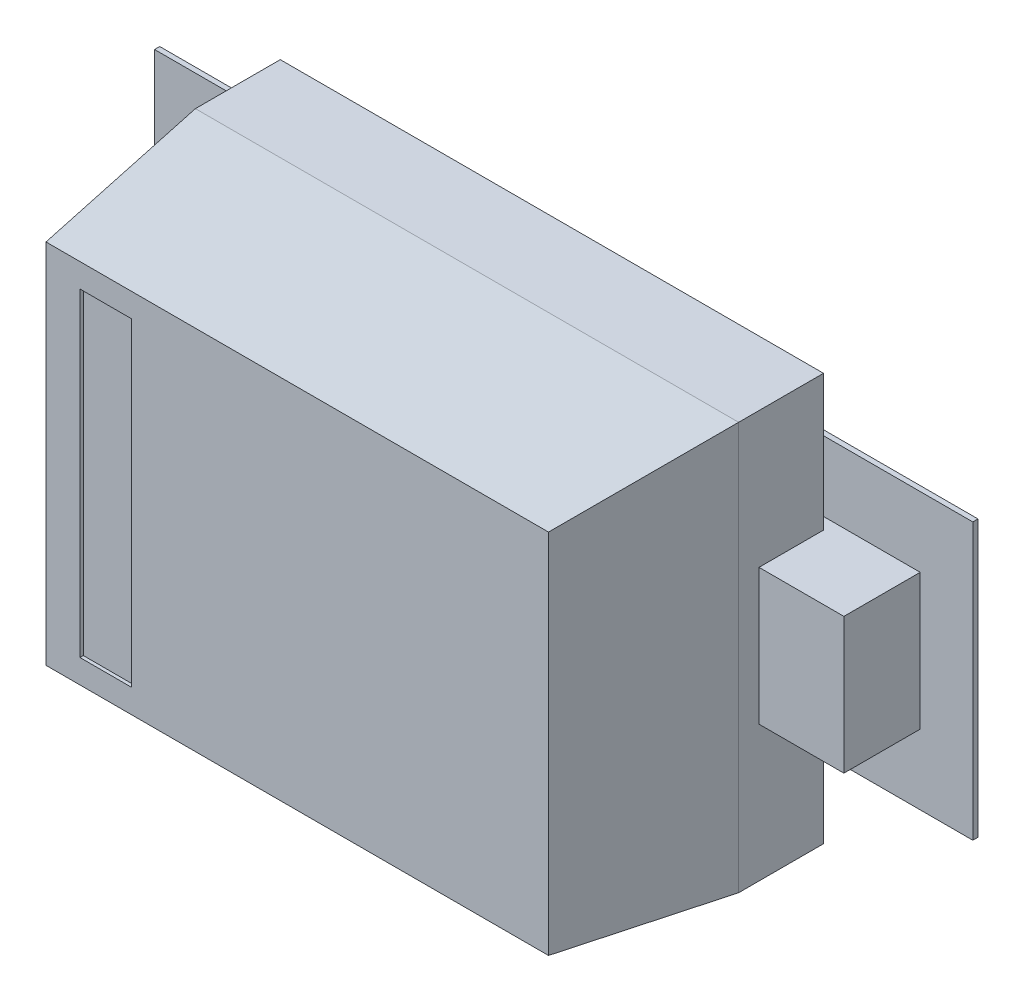
ISO-10303-21;
HEADER;
FILE_DESCRIPTION(('STEP AP214'),'2;1');
FILE_NAME('part.step','',(''),(''),'','','');
FILE_SCHEMA(('AUTOMOTIVE_DESIGN { 1 0 10303 214 1 1 1 1 }'));
ENDSEC;
DATA;
#1=APPLICATION_CONTEXT('core data for automotive mechanical design processes');
#2=APPLICATION_PROTOCOL_DEFINITION('international standard','automotive_design',2000,#1);
#3=PRODUCT_CONTEXT('',#1,'mechanical');
#4=PRODUCT('Part','Part','',(#3));
#5=PRODUCT_RELATED_PRODUCT_CATEGORY('part','',(#4));
#6=PRODUCT_DEFINITION_FORMATION('','',#4);
#7=PRODUCT_DEFINITION_CONTEXT('part definition',#1,'design');
#8=PRODUCT_DEFINITION('design','',#6,#7);
#9=PRODUCT_DEFINITION_SHAPE('','',#8);
#10=(LENGTH_UNIT() NAMED_UNIT(*) SI_UNIT(.MILLI.,.METRE.));
#11=(NAMED_UNIT(*) PLANE_ANGLE_UNIT() SI_UNIT($,.RADIAN.));
#12=(NAMED_UNIT(*) SI_UNIT($,.STERADIAN.) SOLID_ANGLE_UNIT());
#13=UNCERTAINTY_MEASURE_WITH_UNIT(LENGTH_MEASURE(1.E-05),#10,'distance_accuracy_value','');
#14=(GEOMETRIC_REPRESENTATION_CONTEXT(3) GLOBAL_UNCERTAINTY_ASSIGNED_CONTEXT((#13)) GLOBAL_UNIT_ASSIGNED_CONTEXT((#10,
#11,#12)) REPRESENTATION_CONTEXT('',''));
#15=CARTESIAN_POINT('',(0.,0.,0.));
#16=DIRECTION('',(0.,0.,1.));
#17=DIRECTION('',(1.,0.,0.));
#18=AXIS2_PLACEMENT_3D('',#15,#16,#17);
#19=CARTESIAN_POINT('',(-0.525,-0.1,0.0762));
#20=DIRECTION('',(-1.,0.,0.));
#21=DIRECTION('',(0.,0.,1.));
#22=AXIS2_PLACEMENT_3D('',#19,#20,#21);
#23=PLANE('',#22);
#24=DIRECTION('',(0.,1.,0.));
#25=VECTOR('',#24,1.);
#26=CARTESIAN_POINT('',(-0.525,-0.1,0.08382));
#27=LINE('',#26,#25);
#28=CARTESIAN_POINT('',(-0.525,-0.1,0.08382));
#29=VERTEX_POINT('',#28);
#30=CARTESIAN_POINT('',(-0.525,0.1,0.08382));
#31=VERTEX_POINT('',#30);
#32=EDGE_CURVE('E310',#29,#31,#27,.T.);
#33=ORIENTED_EDGE('',*,*,#32,.F.);
#34=DIRECTION('',(0.,0.,1.));
#35=VECTOR('',#34,1.);
#36=CARTESIAN_POINT('',(-0.525,-0.1,0.08382));
#37=LINE('',#36,#35);
#38=CARTESIAN_POINT('',(-0.525,-0.1,0.1962));
#39=VERTEX_POINT('',#38);
#40=EDGE_CURVE('E305',#29,#39,#37,.T.);
#41=ORIENTED_EDGE('',*,*,#40,.T.);
#42=DIRECTION('',(0.,1.,0.));
#43=VECTOR('',#42,1.);
#44=CARTESIAN_POINT('',(-0.525,-0.1,0.1962));
#45=LINE('',#44,#43);
#46=CARTESIAN_POINT('',(-0.525,0.1,0.1962));
#47=VERTEX_POINT('',#46);
#48=EDGE_CURVE('E11',#39,#47,#45,.T.);
#49=ORIENTED_EDGE('',*,*,#48,.T.);
#50=DIRECTION('',(0.,0.,1.));
#51=VECTOR('',#50,1.);
#52=CARTESIAN_POINT('',(-0.525,0.1,0.08382));
#53=LINE('',#52,#51);
#54=EDGE_CURVE('E186',#31,#47,#53,.T.);
#55=ORIENTED_EDGE('',*,*,#54,.F.);
#56=EDGE_LOOP('',(#33,#41,#49,#55));
#57=FACE_BOUND('',#56,.T.);
#58=ADVANCED_FACE('F17',(#57),#23,.T.);
#59=CARTESIAN_POINT('',(-0.525,-0.1,0.1962));
#60=DIRECTION('',(0.,0.,1.));
#61=DIRECTION('',(1.,0.,0.));
#62=AXIS2_PLACEMENT_3D('',#59,#60,#61);
#63=PLANE('',#62);
#64=DIRECTION('',(1.,0.,0.));
#65=VECTOR('',#64,1.);
#66=CARTESIAN_POINT('',(-0.525,-0.1,0.1962));
#67=LINE('',#66,#65);
#68=CARTESIAN_POINT('',(-0.4,-0.1,0.1962));
#69=VERTEX_POINT('',#68);
#70=EDGE_CURVE('E321',#39,#69,#67,.T.);
#71=ORIENTED_EDGE('',*,*,#70,.T.);
#72=DIRECTION('',(0.,1.,0.));
#73=VECTOR('',#72,1.);
#74=CARTESIAN_POINT('',(-0.4,-0.1,0.1962));
#75=LINE('',#74,#73);
#76=CARTESIAN_POINT('',(-0.4,0.1,0.1962));
#77=VERTEX_POINT('',#76);
#78=EDGE_CURVE('E322',#69,#77,#75,.T.);
#79=ORIENTED_EDGE('',*,*,#78,.T.);
#80=DIRECTION('',(1.,0.,0.));
#81=VECTOR('',#80,1.);
#82=CARTESIAN_POINT('',(-0.525,0.1,0.1962));
#83=LINE('',#82,#81);
#84=EDGE_CURVE('E297',#47,#77,#83,.T.);
#85=ORIENTED_EDGE('',*,*,#84,.F.);
#86=ORIENTED_EDGE('',*,*,#48,.F.);
#87=EDGE_LOOP('',(#71,#79,#85,#86));
#88=FACE_BOUND('',#87,.T.);
#89=ADVANCED_FACE('F916',(#88),#63,.T.);
#90=CARTESIAN_POINT('',(-0.325,-0.1,0.1962));
#91=DIRECTION('',(1.,0.,0.));
#92=DIRECTION('',(0.,1.,0.));
#93=AXIS2_PLACEMENT_3D('',#90,#91,#92);
#94=PLANE('',#93);
#95=DIRECTION('',(0.,1.,0.));
#96=VECTOR('',#95,1.);
#97=CARTESIAN_POINT('',(-0.325,-0.1,0.08382));
#98=LINE('',#97,#96);
#99=CARTESIAN_POINT('',(-0.325,-0.1,0.08382));
#100=VERTEX_POINT('',#99);
#101=CARTESIAN_POINT('',(-0.325,0.1,0.08382));
#102=VERTEX_POINT('',#101);
#103=EDGE_CURVE('E309',#100,#102,#98,.T.);
#104=ORIENTED_EDGE('',*,*,#103,.T.);
#105=DIRECTION('',(0.,0.,-1.));
#106=VECTOR('',#105,1.);
#107=CARTESIAN_POINT('',(-0.325,0.1,0.1012));
#108=LINE('',#107,#106);
#109=CARTESIAN_POINT('',(-0.325,0.1,0.1012));
#110=VERTEX_POINT('',#109);
#111=EDGE_CURVE('E28',#110,#102,#108,.T.);
#112=ORIENTED_EDGE('',*,*,#111,.F.);
#113=DIRECTION('',(0.,1.,0.));
#114=VECTOR('',#113,1.);
#115=CARTESIAN_POINT('',(-0.325,-0.1,0.1012));
#116=LINE('',#115,#114);
#117=CARTESIAN_POINT('',(-0.325,-0.1,0.1012));
#118=VERTEX_POINT('',#117);
#119=EDGE_CURVE('E377',#118,#110,#116,.T.);
#120=ORIENTED_EDGE('',*,*,#119,.F.);
#121=DIRECTION('',(0.,0.,-1.));
#122=VECTOR('',#121,1.);
#123=CARTESIAN_POINT('',(-0.325,-0.1,0.1012));
#124=LINE('',#123,#122);
#125=EDGE_CURVE('E404',#118,#100,#124,.T.);
#126=ORIENTED_EDGE('',*,*,#125,.T.);
#127=EDGE_LOOP('',(#104,#112,#120,#126));
#128=FACE_BOUND('',#127,.T.);
#129=ADVANCED_FACE('F913',(#128),#94,.T.);
#130=CARTESIAN_POINT('',(0.325,-0.1,0.0762));
#131=DIRECTION('',(-1.,0.,0.));
#132=DIRECTION('',(0.,0.,1.));
#133=AXIS2_PLACEMENT_3D('',#130,#131,#132);
#134=PLANE('',#133);
#135=DIRECTION('',(0.,1.,0.));
#136=VECTOR('',#135,1.);
#137=CARTESIAN_POINT('',(0.325,-0.1,0.08382));
#138=LINE('',#137,#136);
#139=CARTESIAN_POINT('',(0.325,-0.1,0.08382));
#140=VERTEX_POINT('',#139);
#141=CARTESIAN_POINT('',(0.325,0.1,0.08382));
#142=VERTEX_POINT('',#141);
#143=EDGE_CURVE('E282',#140,#142,#138,.T.);
#144=ORIENTED_EDGE('',*,*,#143,.F.);
#145=DIRECTION('',(0.,0.,1.));
#146=VECTOR('',#145,1.);
#147=CARTESIAN_POINT('',(0.325,-0.1,0.08382));
#148=LINE('',#147,#146);
#149=CARTESIAN_POINT('',(0.325,-0.1,0.1012));
#150=VERTEX_POINT('',#149);
#151=EDGE_CURVE('E500',#140,#150,#148,.T.);
#152=ORIENTED_EDGE('',*,*,#151,.T.);
#153=DIRECTION('',(0.,1.,0.));
#154=VECTOR('',#153,1.);
#155=CARTESIAN_POINT('',(0.325,-0.1,0.1012));
#156=LINE('',#155,#154);
#157=CARTESIAN_POINT('',(0.325,0.1,0.1012));
#158=VERTEX_POINT('',#157);
#159=EDGE_CURVE('E357',#150,#158,#156,.T.);
#160=ORIENTED_EDGE('',*,*,#159,.T.);
#161=DIRECTION('',(0.,0.,1.));
#162=VECTOR('',#161,1.);
#163=CARTESIAN_POINT('',(0.325,0.1,0.08382));
#164=LINE('',#163,#162);
#165=EDGE_CURVE('E497',#142,#158,#164,.T.);
#166=ORIENTED_EDGE('',*,*,#165,.F.);
#167=EDGE_LOOP('',(#144,#152,#160,#166));
#168=FACE_BOUND('',#167,.T.);
#169=ADVANCED_FACE('F495',(#168),#134,.T.);
#170=CARTESIAN_POINT('',(0.,0.1,0.));
#171=DIRECTION('',(0.,1.,0.));
#172=DIRECTION('',(1.,0.,0.));
#173=AXIS2_PLACEMENT_3D('',#170,#171,#172);
#174=PLANE('',#173);
#175=DIRECTION('',(-1.,0.,0.));
#176=VECTOR('',#175,1.);
#177=CARTESIAN_POINT('',(-0.325,0.1,0.08382));
#178=LINE('',#177,#176);
#179=EDGE_CURVE('E306',#102,#31,#178,.T.);
#180=ORIENTED_EDGE('',*,*,#179,.T.);
#181=ORIENTED_EDGE('',*,*,#54,.T.);
#182=ORIENTED_EDGE('',*,*,#84,.T.);
#183=DIRECTION('',(0.,0.,1.));
#184=VECTOR('',#183,1.);
#185=CARTESIAN_POINT('',(-0.4,0.1,0.1012));
#186=LINE('',#185,#184);
#187=CARTESIAN_POINT('',(-0.4,0.1,0.1012));
#188=VERTEX_POINT('',#187);
#189=EDGE_CURVE('E327',#188,#77,#186,.T.);
#190=ORIENTED_EDGE('',*,*,#189,.F.);
#191=DIRECTION('',(1.,0.,0.));
#192=VECTOR('',#191,1.);
#193=CARTESIAN_POINT('',(-0.4,0.1,0.1012));
#194=LINE('',#193,#192);
#195=EDGE_CURVE('E373',#188,#110,#194,.T.);
#196=ORIENTED_EDGE('',*,*,#195,.T.);
#197=ORIENTED_EDGE('',*,*,#111,.T.);
#198=EDGE_LOOP('',(#180,#181,#182,#190,#196,#197));
#199=FACE_BOUND('',#198,.T.);
#200=ADVANCED_FACE('F19',(#199),#174,.T.);
#201=CARTESIAN_POINT('',(0.,0.1,0.));
#202=DIRECTION('',(0.,1.,0.));
#203=DIRECTION('',(1.,0.,0.));
#204=AXIS2_PLACEMENT_3D('',#201,#202,#203);
#205=PLANE('',#204);
#206=DIRECTION('',(-1.,0.,0.));
#207=VECTOR('',#206,1.);
#208=CARTESIAN_POINT('',(0.525,0.1,0.08382));
#209=LINE('',#208,#207);
#210=CARTESIAN_POINT('',(0.525,0.1,0.08382));
#211=VERTEX_POINT('',#210);
#212=EDGE_CURVE('E446',#211,#142,#209,.T.);
#213=ORIENTED_EDGE('',*,*,#212,.T.);
#214=ORIENTED_EDGE('',*,*,#165,.T.);
#215=DIRECTION('',(1.,0.,0.));
#216=VECTOR('',#215,1.);
#217=CARTESIAN_POINT('',(0.325,0.1,0.1012));
#218=LINE('',#217,#216);
#219=CARTESIAN_POINT('',(0.4,0.1,0.1012));
#220=VERTEX_POINT('',#219);
#221=EDGE_CURVE('E409',#158,#220,#218,.T.);
#222=ORIENTED_EDGE('',*,*,#221,.T.);
#223=DIRECTION('',(0.,0.,-1.));
#224=VECTOR('',#223,1.);
#225=CARTESIAN_POINT('',(0.4,0.1,0.1962));
#226=LINE('',#225,#224);
#227=CARTESIAN_POINT('',(0.4,0.1,0.1962));
#228=VERTEX_POINT('',#227);
#229=EDGE_CURVE('E396',#228,#220,#226,.T.);
#230=ORIENTED_EDGE('',*,*,#229,.F.);
#231=DIRECTION('',(1.,0.,0.));
#232=VECTOR('',#231,1.);
#233=CARTESIAN_POINT('',(0.4,0.1,0.1962));
#234=LINE('',#233,#232);
#235=CARTESIAN_POINT('',(0.525,0.1,0.1962));
#236=VERTEX_POINT('',#235);
#237=EDGE_CURVE('E422',#228,#236,#234,.T.);
#238=ORIENTED_EDGE('',*,*,#237,.T.);
#239=DIRECTION('',(0.,0.,-1.));
#240=VECTOR('',#239,1.);
#241=CARTESIAN_POINT('',(0.525,0.1,0.1962));
#242=LINE('',#241,#240);
#243=EDGE_CURVE('E365',#236,#211,#242,.T.);
#244=ORIENTED_EDGE('',*,*,#243,.T.);
#245=EDGE_LOOP('',(#213,#214,#222,#230,#238,#244));
#246=FACE_BOUND('',#245,.T.);
#247=ADVANCED_FACE('F512',(#246),#205,.T.);
#248=CARTESIAN_POINT('',(0.,0.3,0.));
#249=DIRECTION('',(0.,1.,0.));
#250=DIRECTION('',(1.,0.,0.));
#251=AXIS2_PLACEMENT_3D('',#248,#249,#250);
#252=PLANE('',#251);
#253=DIRECTION('',(1.,0.,0.));
#254=VECTOR('',#253,1.);
#255=CARTESIAN_POINT('',(-0.4,0.3,0.2262));
#256=LINE('',#255,#254);
#257=CARTESIAN_POINT('',(-0.4,0.3,0.2262));
#258=VERTEX_POINT('',#257);
#259=CARTESIAN_POINT('',(0.4,0.3,0.2262));
#260=VERTEX_POINT('',#259);
#261=EDGE_CURVE('E204',#258,#260,#256,.T.);
#262=ORIENTED_EDGE('',*,*,#261,.T.);
#263=DIRECTION('',(0.,0.,-1.));
#264=VECTOR('',#263,1.);
#265=CARTESIAN_POINT('',(0.4,0.3,0.2262));
#266=LINE('',#265,#264);
#267=CARTESIAN_POINT('',(0.4,0.3,0.1012));
#268=VERTEX_POINT('',#267);
#269=EDGE_CURVE('E417',#260,#268,#266,.T.);
#270=ORIENTED_EDGE('',*,*,#269,.T.);
#271=DIRECTION('',(-1.,0.,0.));
#272=VECTOR('',#271,1.);
#273=CARTESIAN_POINT('',(0.4,0.3,0.1012));
#274=LINE('',#273,#272);
#275=CARTESIAN_POINT('',(-0.4,0.3,0.1012));
#276=VERTEX_POINT('',#275);
#277=EDGE_CURVE('E376',#268,#276,#274,.T.);
#278=ORIENTED_EDGE('',*,*,#277,.T.);
#279=DIRECTION('',(0.,0.,1.));
#280=VECTOR('',#279,1.);
#281=CARTESIAN_POINT('',(-0.4,0.3,0.1012));
#282=LINE('',#281,#280);
#283=EDGE_CURVE('E565',#276,#258,#282,.T.);
#284=ORIENTED_EDGE('',*,*,#283,.T.);
#285=EDGE_LOOP('',(#262,#270,#278,#284));
#286=FACE_BOUND('',#285,.T.);
#287=ADVANCED_FACE('F563',(#286),#252,.T.);
#288=CARTESIAN_POINT('',(0.,0.285,0.3512));
#289=DIRECTION('',(0.,0.992876838486925,0.119145220618403));
#290=DIRECTION('',(1.,0.,0.));
#291=AXIS2_PLACEMENT_3D('',#288,#289,#290);
#292=PLANE('',#291);
#293=ORIENTED_EDGE('',*,*,#261,.F.);
#294=DIRECTION('',(-0.118308451008796,0.118308451008796,-0.985903758406366));
#295=VECTOR('',#294,1.);
#296=CARTESIAN_POINT('',(-0.37,0.27,0.4762));
#297=LINE('',#296,#295);
#298=CARTESIAN_POINT('',(-0.37,0.27,0.4762));
#299=VERTEX_POINT('',#298);
#300=EDGE_CURVE('E585',#299,#258,#297,.T.);
#301=ORIENTED_EDGE('',*,*,#300,.F.);
#302=DIRECTION('',(1.,0.,0.));
#303=VECTOR('',#302,1.);
#304=CARTESIAN_POINT('',(-0.37,0.27,0.4762));
#305=LINE('',#304,#303);
#306=CARTESIAN_POINT('',(0.37,0.27,0.4762));
#307=VERTEX_POINT('',#306);
#308=EDGE_CURVE('E381',#299,#307,#305,.T.);
#309=ORIENTED_EDGE('',*,*,#308,.T.);
#310=DIRECTION('',(0.118308451008796,0.118308451008796,-0.985903758406366));
#311=VECTOR('',#310,1.);
#312=CARTESIAN_POINT('',(0.37,0.27,0.4762));
#313=LINE('',#312,#311);
#314=EDGE_CURVE('E414',#307,#260,#313,.T.);
#315=ORIENTED_EDGE('',*,*,#314,.T.);
#316=EDGE_LOOP('',(#293,#301,#309,#315));
#317=FACE_BOUND('',#316,.T.);
#318=ADVANCED_FACE('F662',(#317),#292,.T.);
#319=CARTESIAN_POINT('',(0.385,0.,0.3512));
#320=DIRECTION('',(0.992876838486925,0.,0.119145220618403));
#321=DIRECTION('',(0.,-1.,0.));
#322=AXIS2_PLACEMENT_3D('',#319,#320,#321);
#323=PLANE('',#322);
#324=DIRECTION('',(0.,-1.,0.));
#325=VECTOR('',#324,1.);
#326=CARTESIAN_POINT('',(0.4,0.3,0.2262));
#327=LINE('',#326,#325);
#328=CARTESIAN_POINT('',(0.4,-0.3,0.2262));
#329=VERTEX_POINT('',#328);
#330=EDGE_CURVE('E393',#260,#329,#327,.T.);
#331=ORIENTED_EDGE('',*,*,#330,.F.);
#332=ORIENTED_EDGE('',*,*,#314,.F.);
#333=DIRECTION('',(0.,-1.,0.));
#334=VECTOR('',#333,1.);
#335=CARTESIAN_POINT('',(0.37,0.27,0.4762));
#336=LINE('',#335,#334);
#337=CARTESIAN_POINT('',(0.37,-0.27,0.4762));
#338=VERTEX_POINT('',#337);
#339=EDGE_CURVE('E378',#307,#338,#336,.T.);
#340=ORIENTED_EDGE('',*,*,#339,.T.);
#341=DIRECTION('',(0.118308451008796,-0.118308451008796,-0.985903758406366));
#342=VECTOR('',#341,1.);
#343=CARTESIAN_POINT('',(0.37,-0.27,0.4762));
#344=LINE('',#343,#342);
#345=EDGE_CURVE('E371',#338,#329,#344,.T.);
#346=ORIENTED_EDGE('',*,*,#345,.T.);
#347=EDGE_LOOP('',(#331,#332,#340,#346));
#348=FACE_BOUND('',#347,.T.);
#349=ADVANCED_FACE('F671',(#348),#323,.T.);
#350=CARTESIAN_POINT('',(0.4,-0.3,0.4762));
#351=DIRECTION('',(1.,0.,0.));
#352=DIRECTION('',(0.,1.,0.));
#353=AXIS2_PLACEMENT_3D('',#350,#351,#352);
#354=PLANE('',#353);
#355=ORIENTED_EDGE('',*,*,#330,.T.);
#356=DIRECTION('',(0.,0.,-1.));
#357=VECTOR('',#356,1.);
#358=CARTESIAN_POINT('',(0.4,-0.3,0.2262));
#359=LINE('',#358,#357);
#360=CARTESIAN_POINT('',(0.4,-0.3,0.1012));
#361=VERTEX_POINT('',#360);
#362=EDGE_CURVE('E21',#329,#361,#359,.T.);
#363=ORIENTED_EDGE('',*,*,#362,.T.);
#364=DIRECTION('',(0.,1.,0.));
#365=VECTOR('',#364,1.);
#366=CARTESIAN_POINT('',(0.4,-0.3,0.1012));
#367=LINE('',#366,#365);
#368=CARTESIAN_POINT('',(0.4,-0.1,0.1012));
#369=VERTEX_POINT('',#368);
#370=EDGE_CURVE('E335',#361,#369,#367,.T.);
#371=ORIENTED_EDGE('',*,*,#370,.T.);
#372=DIRECTION('',(0.,0.,-1.));
#373=VECTOR('',#372,1.);
#374=CARTESIAN_POINT('',(0.4,-0.1,0.1962));
#375=LINE('',#374,#373);
#376=CARTESIAN_POINT('',(0.4,-0.1,0.1962));
#377=VERTEX_POINT('',#376);
#378=EDGE_CURVE('E535',#377,#369,#375,.T.);
#379=ORIENTED_EDGE('',*,*,#378,.F.);
#380=DIRECTION('',(0.,1.,0.));
#381=VECTOR('',#380,1.);
#382=CARTESIAN_POINT('',(0.4,-0.1,0.1962));
#383=LINE('',#382,#381);
#384=EDGE_CURVE('E397',#377,#228,#383,.T.);
#385=ORIENTED_EDGE('',*,*,#384,.T.);
#386=ORIENTED_EDGE('',*,*,#229,.T.);
#387=DIRECTION('',(0.,1.,0.));
#388=VECTOR('',#387,1.);
#389=CARTESIAN_POINT('',(0.4,0.1,0.1012));
#390=LINE('',#389,#388);
#391=EDGE_CURVE('E413',#220,#268,#390,.T.);
#392=ORIENTED_EDGE('',*,*,#391,.T.);
#393=ORIENTED_EDGE('',*,*,#269,.F.);
#394=EDGE_LOOP('',(#355,#363,#371,#379,#385,#386,#392,#393));
#395=FACE_BOUND('',#394,.T.);
#396=ADVANCED_FACE('F536',(#395),#354,.T.);
#397=CARTESIAN_POINT('',(0.325,-0.1,0.1962));
#398=DIRECTION('',(0.,0.,1.));
#399=DIRECTION('',(1.,0.,0.));
#400=AXIS2_PLACEMENT_3D('',#397,#398,#399);
#401=PLANE('',#400);
#402=DIRECTION('',(1.,0.,0.));
#403=VECTOR('',#402,1.);
#404=CARTESIAN_POINT('',(0.4,-0.1,0.1962));
#405=LINE('',#404,#403);
#406=CARTESIAN_POINT('',(0.525,-0.1,0.1962));
#407=VERTEX_POINT('',#406);
#408=EDGE_CURVE('E344',#377,#407,#405,.T.);
#409=ORIENTED_EDGE('',*,*,#408,.T.);
#410=DIRECTION('',(0.,1.,0.));
#411=VECTOR('',#410,1.);
#412=CARTESIAN_POINT('',(0.525,-0.1,0.1962));
#413=LINE('',#412,#411);
#414=EDGE_CURVE('E418',#407,#236,#413,.T.);
#415=ORIENTED_EDGE('',*,*,#414,.T.);
#416=ORIENTED_EDGE('',*,*,#237,.F.);
#417=ORIENTED_EDGE('',*,*,#384,.F.);
#418=EDGE_LOOP('',(#409,#415,#416,#417));
#419=FACE_BOUND('',#418,.T.);
#420=ADVANCED_FACE('F532',(#419),#401,.T.);
#421=CARTESIAN_POINT('',(0.525,-0.1,0.1962));
#422=DIRECTION('',(1.,0.,0.));
#423=DIRECTION('',(0.,1.,0.));
#424=AXIS2_PLACEMENT_3D('',#421,#422,#423);
#425=PLANE('',#424);
#426=DIRECTION('',(0.,1.,0.));
#427=VECTOR('',#426,1.);
#428=CARTESIAN_POINT('',(0.525,-0.1,0.08382));
#429=LINE('',#428,#427);
#430=CARTESIAN_POINT('',(0.525,-0.1,0.08382));
#431=VERTEX_POINT('',#430);
#432=EDGE_CURVE('E441',#431,#211,#429,.T.);
#433=ORIENTED_EDGE('',*,*,#432,.T.);
#434=ORIENTED_EDGE('',*,*,#243,.F.);
#435=ORIENTED_EDGE('',*,*,#414,.F.);
#436=DIRECTION('',(0.,0.,-1.));
#437=VECTOR('',#436,1.);
#438=CARTESIAN_POINT('',(0.525,-0.1,0.1962));
#439=LINE('',#438,#437);
#440=EDGE_CURVE('E334',#407,#431,#439,.T.);
#441=ORIENTED_EDGE('',*,*,#440,.T.);
#442=EDGE_LOOP('',(#433,#434,#435,#441));
#443=FACE_BOUND('',#442,.T.);
#444=ADVANCED_FACE('F985',(#443),#425,.T.);
#445=CARTESIAN_POINT('',(-0.2975102,-0.2029968,0.0762));
#446=DIRECTION('',(1.,0.,0.));
#447=DIRECTION('',(0.,1.,0.));
#448=AXIS2_PLACEMENT_3D('',#445,#446,#447);
#449=PLANE('',#448);
#450=DIRECTION('',(0.,1.,0.));
#451=VECTOR('',#450,1.);
#452=CARTESIAN_POINT('',(-0.2975102,-0.2029968,0.0762));
#453=LINE('',#452,#451);
#454=CARTESIAN_POINT('',(-0.2975102,-0.2029968,0.0762));
#455=VERTEX_POINT('',#454);
#456=CARTESIAN_POINT('',(-0.2975102,0.2029968,0.0762));
#457=VERTEX_POINT('',#456);
#458=EDGE_CURVE('E447',#455,#457,#453,.T.);
#459=ORIENTED_EDGE('',*,*,#458,.T.);
#460=DIRECTION('',(0.,0.,1.));
#461=VECTOR('',#460,1.);
#462=CARTESIAN_POINT('',(-0.2975102,0.2029968,0.0762));
#463=LINE('',#462,#461);
#464=CARTESIAN_POINT('',(-0.2975102,0.2029968,0.08382));
#465=VERTEX_POINT('',#464);
#466=EDGE_CURVE('E475',#457,#465,#463,.T.);
#467=ORIENTED_EDGE('',*,*,#466,.T.);
#468=DIRECTION('',(0.,1.,0.));
#469=VECTOR('',#468,1.);
#470=CARTESIAN_POINT('',(-0.2975102,-0.2029968,0.08382));
#471=LINE('',#470,#469);
#472=CARTESIAN_POINT('',(-0.2975102,-0.2029968,0.08382));
#473=VERTEX_POINT('',#472);
#474=EDGE_CURVE('E314',#473,#465,#471,.T.);
#475=ORIENTED_EDGE('',*,*,#474,.F.);
#476=DIRECTION('',(0.,0.,1.));
#477=VECTOR('',#476,1.);
#478=CARTESIAN_POINT('',(-0.2975102,-0.2029968,0.0762));
#479=LINE('',#478,#477);
#480=EDGE_CURVE('E362',#455,#473,#479,.T.);
#481=ORIENTED_EDGE('',*,*,#480,.F.);
#482=EDGE_LOOP('',(#459,#467,#475,#481));
#483=FACE_BOUND('',#482,.T.);
#484=ADVANCED_FACE('F940',(#483),#449,.T.);
#485=CARTESIAN_POINT('',(-0.602488,-0.2029968,0.0762));
#486=DIRECTION('',(0.,-1.,0.));
#487=DIRECTION('',(0.,0.,-1.));
#488=AXIS2_PLACEMENT_3D('',#485,#486,#487);
#489=PLANE('',#488);
#490=DIRECTION('',(1.,0.,0.));
#491=VECTOR('',#490,1.);
#492=CARTESIAN_POINT('',(-0.602488,-0.2029968,0.0762));
#493=LINE('',#492,#491);
#494=CARTESIAN_POINT('',(-0.602488,-0.2029968,0.0762));
#495=VERTEX_POINT('',#494);
#496=EDGE_CURVE('E451',#495,#455,#493,.T.);
#497=ORIENTED_EDGE('',*,*,#496,.T.);
#498=ORIENTED_EDGE('',*,*,#480,.T.);
#499=DIRECTION('',(1.,0.,0.));
#500=VECTOR('',#499,1.);
#501=CARTESIAN_POINT('',(-0.602488,-0.2029968,0.08382));
#502=LINE('',#501,#500);
#503=CARTESIAN_POINT('',(-0.602488,-0.2029968,0.08382));
#504=VERTEX_POINT('',#503);
#505=EDGE_CURVE('E315',#504,#473,#502,.T.);
#506=ORIENTED_EDGE('',*,*,#505,.F.);
#507=DIRECTION('',(0.,0.,1.));
#508=VECTOR('',#507,1.);
#509=CARTESIAN_POINT('',(-0.602488,-0.2029968,0.0762));
#510=LINE('',#509,#508);
#511=EDGE_CURVE('E366',#495,#504,#510,.T.);
#512=ORIENTED_EDGE('',*,*,#511,.F.);
#513=EDGE_LOOP('',(#497,#498,#506,#512));
#514=FACE_BOUND('',#513,.T.);
#515=ADVANCED_FACE('F937',(#514),#489,.T.);
#516=CARTESIAN_POINT('',(-0.602488,0.2029968,0.0762));
#517=DIRECTION('',(-1.,0.,0.));
#518=DIRECTION('',(0.,0.,1.));
#519=AXIS2_PLACEMENT_3D('',#516,#517,#518);
#520=PLANE('',#519);
#521=DIRECTION('',(0.,-1.,0.));
#522=VECTOR('',#521,1.);
#523=CARTESIAN_POINT('',(-0.602488,0.2029968,0.0762));
#524=LINE('',#523,#522);
#525=CARTESIAN_POINT('',(-0.602488,0.2029968,0.0762));
#526=VERTEX_POINT('',#525);
#527=EDGE_CURVE('E330',#526,#495,#524,.T.);
#528=ORIENTED_EDGE('',*,*,#527,.T.);
#529=ORIENTED_EDGE('',*,*,#511,.T.);
#530=DIRECTION('',(0.,-1.,0.));
#531=VECTOR('',#530,1.);
#532=CARTESIAN_POINT('',(-0.602488,0.2029968,0.08382));
#533=LINE('',#532,#531);
#534=CARTESIAN_POINT('',(-0.602488,0.2029968,0.08382));
#535=VERTEX_POINT('',#534);
#536=EDGE_CURVE('E304',#535,#504,#533,.T.);
#537=ORIENTED_EDGE('',*,*,#536,.F.);
#538=DIRECTION('',(0.,0.,1.));
#539=VECTOR('',#538,1.);
#540=CARTESIAN_POINT('',(-0.602488,0.2029968,0.0762));
#541=LINE('',#540,#539);
#542=EDGE_CURVE('E602',#526,#535,#541,.T.);
#543=ORIENTED_EDGE('',*,*,#542,.F.);
#544=EDGE_LOOP('',(#528,#529,#537,#543));
#545=FACE_BOUND('',#544,.T.);
#546=ADVANCED_FACE('F933',(#545),#520,.T.);
#547=CARTESIAN_POINT('',(0.2975102,0.2029968,0.0762));
#548=DIRECTION('',(-1.,0.,0.));
#549=DIRECTION('',(0.,0.,1.));
#550=AXIS2_PLACEMENT_3D('',#547,#548,#549);
#551=PLANE('',#550);
#552=DIRECTION('',(0.,-1.,0.));
#553=VECTOR('',#552,1.);
#554=CARTESIAN_POINT('',(0.2975102,0.2029968,0.0762));
#555=LINE('',#554,#553);
#556=CARTESIAN_POINT('',(0.2975102,0.2029968,0.0762));
#557=VERTEX_POINT('',#556);
#558=CARTESIAN_POINT('',(0.2975102,-0.2029968,0.0762));
#559=VERTEX_POINT('',#558);
#560=EDGE_CURVE('E452',#557,#559,#555,.T.);
#561=ORIENTED_EDGE('',*,*,#560,.T.);
#562=DIRECTION('',(0.,0.,1.));
#563=VECTOR('',#562,1.);
#564=CARTESIAN_POINT('',(0.2975102,-0.2029968,0.0762));
#565=LINE('',#564,#563);
#566=CARTESIAN_POINT('',(0.2975102,-0.2029968,0.08382));
#567=VERTEX_POINT('',#566);
#568=EDGE_CURVE('E136',#559,#567,#565,.T.);
#569=ORIENTED_EDGE('',*,*,#568,.T.);
#570=DIRECTION('',(0.,-1.,0.));
#571=VECTOR('',#570,1.);
#572=CARTESIAN_POINT('',(0.2975102,0.2029968,0.08382));
#573=LINE('',#572,#571);
#574=CARTESIAN_POINT('',(0.2975102,0.2029968,0.08382));
#575=VERTEX_POINT('',#574);
#576=EDGE_CURVE('E286',#575,#567,#573,.T.);
#577=ORIENTED_EDGE('',*,*,#576,.F.);
#578=DIRECTION('',(0.,0.,1.));
#579=VECTOR('',#578,1.);
#580=CARTESIAN_POINT('',(0.2975102,0.2029968,0.0762));
#581=LINE('',#580,#579);
#582=EDGE_CURVE('E328',#557,#575,#581,.T.);
#583=ORIENTED_EDGE('',*,*,#582,.F.);
#584=EDGE_LOOP('',(#561,#569,#577,#583));
#585=FACE_BOUND('',#584,.T.);
#586=ADVANCED_FACE('F996',(#585),#551,.T.);
#587=CARTESIAN_POINT('',(0.2975102,-0.2029968,0.0762));
#588=DIRECTION('',(0.,-1.,0.));
#589=DIRECTION('',(0.,0.,-1.));
#590=AXIS2_PLACEMENT_3D('',#587,#588,#589);
#591=PLANE('',#590);
#592=DIRECTION('',(1.,0.,0.));
#593=VECTOR('',#592,1.);
#594=CARTESIAN_POINT('',(0.2975102,-0.2029968,0.0762));
#595=LINE('',#594,#593);
#596=CARTESIAN_POINT('',(0.602488,-0.2029968,0.0762));
#597=VERTEX_POINT('',#596);
#598=EDGE_CURVE('E270',#559,#597,#595,.T.);
#599=ORIENTED_EDGE('',*,*,#598,.T.);
#600=DIRECTION('',(0.,0.,1.));
#601=VECTOR('',#600,1.);
#602=CARTESIAN_POINT('',(0.602488,-0.2029968,0.0762));
#603=LINE('',#602,#601);
#604=CARTESIAN_POINT('',(0.602488,-0.2029968,0.08382));
#605=VERTEX_POINT('',#604);
#606=EDGE_CURVE('E149',#597,#605,#603,.T.);
#607=ORIENTED_EDGE('',*,*,#606,.T.);
#608=DIRECTION('',(1.,0.,0.));
#609=VECTOR('',#608,1.);
#610=CARTESIAN_POINT('',(0.2975102,-0.2029968,0.08382));
#611=LINE('',#610,#609);
#612=EDGE_CURVE('E267',#567,#605,#611,.T.);
#613=ORIENTED_EDGE('',*,*,#612,.F.);
#614=ORIENTED_EDGE('',*,*,#568,.F.);
#615=EDGE_LOOP('',(#599,#607,#613,#614));
#616=FACE_BOUND('',#615,.T.);
#617=ADVANCED_FACE('F265',(#616),#591,.T.);
#618=CARTESIAN_POINT('',(0.602488,-0.2029968,0.0762));
#619=DIRECTION('',(1.,0.,0.));
#620=DIRECTION('',(0.,1.,0.));
#621=AXIS2_PLACEMENT_3D('',#618,#619,#620);
#622=PLANE('',#621);
#623=DIRECTION('',(0.,1.,0.));
#624=VECTOR('',#623,1.);
#625=CARTESIAN_POINT('',(0.602488,-0.2029968,0.0762));
#626=LINE('',#625,#624);
#627=CARTESIAN_POINT('',(0.602488,0.2029968,0.0762));
#628=VERTEX_POINT('',#627);
#629=EDGE_CURVE('E432',#597,#628,#626,.T.);
#630=ORIENTED_EDGE('',*,*,#629,.T.);
#631=DIRECTION('',(0.,0.,1.));
#632=VECTOR('',#631,1.);
#633=CARTESIAN_POINT('',(0.602488,0.2029968,0.0762));
#634=LINE('',#633,#632);
#635=CARTESIAN_POINT('',(0.602488,0.2029968,0.08382));
#636=VERTEX_POINT('',#635);
#637=EDGE_CURVE('E273',#628,#636,#634,.T.);
#638=ORIENTED_EDGE('',*,*,#637,.T.);
#639=DIRECTION('',(0.,1.,0.));
#640=VECTOR('',#639,1.);
#641=CARTESIAN_POINT('',(0.602488,-0.2029968,0.08382));
#642=LINE('',#641,#640);
#643=EDGE_CURVE('E276',#605,#636,#642,.T.);
#644=ORIENTED_EDGE('',*,*,#643,.F.);
#645=ORIENTED_EDGE('',*,*,#606,.F.);
#646=EDGE_LOOP('',(#630,#638,#644,#645));
#647=FACE_BOUND('',#646,.T.);
#648=ADVANCED_FACE('F277',(#647),#622,.T.);
#649=CARTESIAN_POINT('',(0.602488,0.2029968,0.0762));
#650=DIRECTION('',(0.,1.,0.));
#651=DIRECTION('',(1.,0.,0.));
#652=AXIS2_PLACEMENT_3D('',#649,#650,#651);
#653=PLANE('',#652);
#654=DIRECTION('',(-1.,0.,0.));
#655=VECTOR('',#654,1.);
#656=CARTESIAN_POINT('',(0.602488,0.2029968,0.0762));
#657=LINE('',#656,#655);
#658=EDGE_CURVE('E435',#628,#557,#657,.T.);
#659=ORIENTED_EDGE('',*,*,#658,.T.);
#660=ORIENTED_EDGE('',*,*,#582,.T.);
#661=DIRECTION('',(-1.,0.,0.));
#662=VECTOR('',#661,1.);
#663=CARTESIAN_POINT('',(0.602488,0.2029968,0.08382));
#664=LINE('',#663,#662);
#665=EDGE_CURVE('E293',#636,#575,#664,.T.);
#666=ORIENTED_EDGE('',*,*,#665,.F.);
#667=ORIENTED_EDGE('',*,*,#637,.F.);
#668=EDGE_LOOP('',(#659,#660,#666,#667));
#669=FACE_BOUND('',#668,.T.);
#670=ADVANCED_FACE('F945',(#669),#653,.T.);
#671=CARTESIAN_POINT('',(-0.325,-0.1,0.0762));
#672=DIRECTION('',(0.,0.,-1.));
#673=DIRECTION('',(0.,-1.,0.));
#674=AXIS2_PLACEMENT_3D('',#671,#672,#673);
#675=PLANE('',#674);
#676=DIRECTION('',(-1.,0.,0.));
#677=VECTOR('',#676,1.);
#678=CARTESIAN_POINT('',(-0.2975102,0.2029968,0.0762));
#679=LINE('',#678,#677);
#680=EDGE_CURVE('E445',#457,#526,#679,.T.);
#681=ORIENTED_EDGE('',*,*,#680,.F.);
#682=ORIENTED_EDGE('',*,*,#458,.F.);
#683=ORIENTED_EDGE('',*,*,#496,.F.);
#684=ORIENTED_EDGE('',*,*,#527,.F.);
#685=EDGE_LOOP('',(#681,#682,#683,#684));
#686=FACE_BOUND('',#685,.T.);
#687=ADVANCED_FACE('F942',(#686),#675,.T.);
#688=CARTESIAN_POINT('',(-0.325,-0.1,0.0762));
#689=DIRECTION('',(0.,0.,-1.));
#690=DIRECTION('',(0.,-1.,0.));
#691=AXIS2_PLACEMENT_3D('',#688,#689,#690);
#692=PLANE('',#691);
#693=ORIENTED_EDGE('',*,*,#658,.F.);
#694=ORIENTED_EDGE('',*,*,#629,.F.);
#695=ORIENTED_EDGE('',*,*,#598,.F.);
#696=ORIENTED_EDGE('',*,*,#560,.F.);
#697=EDGE_LOOP('',(#693,#694,#695,#696));
#698=FACE_BOUND('',#697,.T.);
#699=ADVANCED_FACE('F944',(#698),#692,.T.);
#700=CARTESIAN_POINT('',(-0.2975102,0.2029968,0.0762));
#701=DIRECTION('',(0.,1.,0.));
#702=DIRECTION('',(1.,0.,0.));
#703=AXIS2_PLACEMENT_3D('',#700,#701,#702);
#704=PLANE('',#703);
#705=ORIENTED_EDGE('',*,*,#680,.T.);
#706=ORIENTED_EDGE('',*,*,#542,.T.);
#707=DIRECTION('',(-1.,0.,0.));
#708=VECTOR('',#707,1.);
#709=CARTESIAN_POINT('',(-0.2975102,0.2029968,0.08382));
#710=LINE('',#709,#708);
#711=EDGE_CURVE('E300',#465,#535,#710,.T.);
#712=ORIENTED_EDGE('',*,*,#711,.F.);
#713=ORIENTED_EDGE('',*,*,#466,.F.);
#714=EDGE_LOOP('',(#705,#706,#712,#713));
#715=FACE_BOUND('',#714,.T.);
#716=ADVANCED_FACE('F929',(#715),#704,.T.);
#717=CARTESIAN_POINT('',(0.,0.,0.08382));
#718=DIRECTION('',(0.,0.,1.));
#719=DIRECTION('',(1.,0.,0.));
#720=AXIS2_PLACEMENT_3D('',#717,#718,#719);
#721=PLANE('',#720);
#722=DIRECTION('',(-1.,0.,0.));
#723=VECTOR('',#722,1.);
#724=CARTESIAN_POINT('',(0.525,-0.1,0.08382));
#725=LINE('',#724,#723);
#726=EDGE_CURVE('E331',#431,#140,#725,.T.);
#727=ORIENTED_EDGE('',*,*,#726,.T.);
#728=ORIENTED_EDGE('',*,*,#143,.T.);
#729=ORIENTED_EDGE('',*,*,#212,.F.);
#730=ORIENTED_EDGE('',*,*,#432,.F.);
#731=EDGE_LOOP('',(#727,#728,#729,#730));
#732=FACE_BOUND('',#731,.T.);
#733=ORIENTED_EDGE('',*,*,#665,.T.);
#734=ORIENTED_EDGE('',*,*,#576,.T.);
#735=ORIENTED_EDGE('',*,*,#612,.T.);
#736=ORIENTED_EDGE('',*,*,#643,.T.);
#737=EDGE_LOOP('',(#733,#734,#735,#736));
#738=FACE_BOUND('',#737,.T.);
#739=ADVANCED_FACE('F284',(#732,#738),#721,.T.);
#740=CARTESIAN_POINT('',(0.,0.,0.08382));
#741=DIRECTION('',(0.,0.,1.));
#742=DIRECTION('',(1.,0.,0.));
#743=AXIS2_PLACEMENT_3D('',#740,#741,#742);
#744=PLANE('',#743);
#745=DIRECTION('',(-1.,0.,0.));
#746=VECTOR('',#745,1.);
#747=CARTESIAN_POINT('',(-0.325,-0.1,0.08382));
#748=LINE('',#747,#746);
#749=EDGE_CURVE('E408',#100,#29,#748,.T.);
#750=ORIENTED_EDGE('',*,*,#749,.T.);
#751=ORIENTED_EDGE('',*,*,#32,.T.);
#752=ORIENTED_EDGE('',*,*,#179,.F.);
#753=ORIENTED_EDGE('',*,*,#103,.F.);
#754=EDGE_LOOP('',(#750,#751,#752,#753));
#755=FACE_BOUND('',#754,.T.);
#756=ORIENTED_EDGE('',*,*,#711,.T.);
#757=ORIENTED_EDGE('',*,*,#536,.T.);
#758=ORIENTED_EDGE('',*,*,#505,.T.);
#759=ORIENTED_EDGE('',*,*,#474,.T.);
#760=EDGE_LOOP('',(#756,#757,#758,#759));
#761=FACE_BOUND('',#760,.T.);
#762=ADVANCED_FACE('F918',(#755,#761),#744,.T.);
#763=CARTESIAN_POINT('',(0.,-0.1,0.));
#764=DIRECTION('',(0.,1.,0.));
#765=DIRECTION('',(1.,0.,0.));
#766=AXIS2_PLACEMENT_3D('',#763,#764,#765);
#767=PLANE('',#766);
#768=ORIENTED_EDGE('',*,*,#749,.F.);
#769=ORIENTED_EDGE('',*,*,#125,.F.);
#770=DIRECTION('',(1.,0.,0.));
#771=VECTOR('',#770,1.);
#772=CARTESIAN_POINT('',(-0.4,-0.1,0.1012));
#773=LINE('',#772,#771);
#774=CARTESIAN_POINT('',(-0.4,-0.1,0.1012));
#775=VERTEX_POINT('',#774);
#776=EDGE_CURVE('E389',#775,#118,#773,.T.);
#777=ORIENTED_EDGE('',*,*,#776,.F.);
#778=DIRECTION('',(0.,0.,1.));
#779=VECTOR('',#778,1.);
#780=CARTESIAN_POINT('',(-0.4,-0.1,0.1012));
#781=LINE('',#780,#779);
#782=EDGE_CURVE('E326',#775,#69,#781,.T.);
#783=ORIENTED_EDGE('',*,*,#782,.T.);
#784=ORIENTED_EDGE('',*,*,#70,.F.);
#785=ORIENTED_EDGE('',*,*,#40,.F.);
#786=EDGE_LOOP('',(#768,#769,#777,#783,#784,#785));
#787=FACE_BOUND('',#786,.T.);
#788=ADVANCED_FACE('F909',(#787),#767,.F.);
#789=CARTESIAN_POINT('',(0.,-0.1,0.));
#790=DIRECTION('',(0.,1.,0.));
#791=DIRECTION('',(1.,0.,0.));
#792=AXIS2_PLACEMENT_3D('',#789,#790,#791);
#793=PLANE('',#792);
#794=ORIENTED_EDGE('',*,*,#726,.F.);
#795=ORIENTED_EDGE('',*,*,#440,.F.);
#796=ORIENTED_EDGE('',*,*,#408,.F.);
#797=ORIENTED_EDGE('',*,*,#378,.T.);
#798=DIRECTION('',(1.,0.,0.));
#799=VECTOR('',#798,1.);
#800=CARTESIAN_POINT('',(0.325,-0.1,0.1012));
#801=LINE('',#800,#799);
#802=EDGE_CURVE('E347',#150,#369,#801,.T.);
#803=ORIENTED_EDGE('',*,*,#802,.F.);
#804=ORIENTED_EDGE('',*,*,#151,.F.);
#805=EDGE_LOOP('',(#794,#795,#796,#797,#803,#804));
#806=FACE_BOUND('',#805,.T.);
#807=ADVANCED_FACE('F540',(#806),#793,.F.);
#808=CARTESIAN_POINT('',(-0.41,-0.3302,0.1012));
#809=DIRECTION('',(0.,0.,1.));
#810=DIRECTION('',(1.,0.,0.));
#811=AXIS2_PLACEMENT_3D('',#808,#809,#810);
#812=PLANE('',#811);
#813=ORIENTED_EDGE('',*,*,#776,.T.);
#814=ORIENTED_EDGE('',*,*,#119,.T.);
#815=ORIENTED_EDGE('',*,*,#195,.F.);
#816=DIRECTION('',(0.,1.,0.));
#817=VECTOR('',#816,1.);
#818=CARTESIAN_POINT('',(-0.4,0.1,0.1012));
#819=LINE('',#818,#817);
#820=EDGE_CURVE('E569',#188,#276,#819,.T.);
#821=ORIENTED_EDGE('',*,*,#820,.T.);
#822=ORIENTED_EDGE('',*,*,#277,.F.);
#823=ORIENTED_EDGE('',*,*,#391,.F.);
#824=ORIENTED_EDGE('',*,*,#221,.F.);
#825=ORIENTED_EDGE('',*,*,#159,.F.);
#826=ORIENTED_EDGE('',*,*,#802,.T.);
#827=ORIENTED_EDGE('',*,*,#370,.F.);
#828=DIRECTION('',(-1.,0.,0.));
#829=VECTOR('',#828,1.);
#830=CARTESIAN_POINT('',(0.4,-0.3,0.1012));
#831=LINE('',#830,#829);
#832=CARTESIAN_POINT('',(-0.4,-0.3,0.1012));
#833=VERTEX_POINT('',#832);
#834=EDGE_CURVE('E592',#361,#833,#831,.T.);
#835=ORIENTED_EDGE('',*,*,#834,.T.);
#836=DIRECTION('',(0.,1.,0.));
#837=VECTOR('',#836,1.);
#838=CARTESIAN_POINT('',(-0.4,-0.3,0.1012));
#839=LINE('',#838,#837);
#840=EDGE_CURVE('E360',#833,#775,#839,.T.);
#841=ORIENTED_EDGE('',*,*,#840,.T.);
#842=EDGE_LOOP('',(#813,#814,#815,#821,#822,#823,#824,#825,#826,#827,#835,#841));
#843=FACE_BOUND('',#842,.T.);
#844=ADVANCED_FACE('F508',(#843),#812,.F.);
#845=CARTESIAN_POINT('',(-0.4,-0.3,0.0762));
#846=DIRECTION('',(-1.,0.,0.));
#847=DIRECTION('',(0.,0.,1.));
#848=AXIS2_PLACEMENT_3D('',#845,#846,#847);
#849=PLANE('',#848);
#850=DIRECTION('',(0.,0.,1.));
#851=VECTOR('',#850,1.);
#852=CARTESIAN_POINT('',(-0.4,-0.3,0.1012));
#853=LINE('',#852,#851);
#854=CARTESIAN_POINT('',(-0.4,-0.3,0.2262));
#855=VERTEX_POINT('',#854);
#856=EDGE_CURVE('E386',#833,#855,#853,.T.);
#857=ORIENTED_EDGE('',*,*,#856,.T.);
#858=DIRECTION('',(0.,-1.,0.));
#859=VECTOR('',#858,1.);
#860=CARTESIAN_POINT('',(-0.4,0.3,0.2262));
#861=LINE('',#860,#859);
#862=EDGE_CURVE('E578',#258,#855,#861,.T.);
#863=ORIENTED_EDGE('',*,*,#862,.F.);
#864=ORIENTED_EDGE('',*,*,#283,.F.);
#865=ORIENTED_EDGE('',*,*,#820,.F.);
#866=ORIENTED_EDGE('',*,*,#189,.T.);
#867=ORIENTED_EDGE('',*,*,#78,.F.);
#868=ORIENTED_EDGE('',*,*,#782,.F.);
#869=ORIENTED_EDGE('',*,*,#840,.F.);
#870=EDGE_LOOP('',(#857,#863,#864,#865,#866,#867,#868,#869));
#871=FACE_BOUND('',#870,.T.);
#872=ADVANCED_FACE('F576',(#871),#849,.T.);
#873=CARTESIAN_POINT('',(-0.385,0.,0.3512));
#874=DIRECTION('',(-0.992876838486925,0.,0.119145220618403));
#875=DIRECTION('',(0.,1.,0.));
#876=AXIS2_PLACEMENT_3D('',#873,#874,#875);
#877=PLANE('',#876);
#878=DIRECTION('',(0.118308451008796,0.118308451008796,0.985903758406366));
#879=VECTOR('',#878,1.);
#880=CARTESIAN_POINT('',(-0.4,-0.3,0.2262));
#881=LINE('',#880,#879);
#882=CARTESIAN_POINT('',(-0.37,-0.27,0.4762));
#883=VERTEX_POINT('',#882);
#884=EDGE_CURVE('E367',#855,#883,#881,.T.);
#885=ORIENTED_EDGE('',*,*,#884,.T.);
#886=DIRECTION('',(0.,-1.,0.));
#887=VECTOR('',#886,1.);
#888=CARTESIAN_POINT('',(-0.37,0.27,0.4762));
#889=LINE('',#888,#887);
#890=EDGE_CURVE('E428',#299,#883,#889,.T.);
#891=ORIENTED_EDGE('',*,*,#890,.F.);
#892=ORIENTED_EDGE('',*,*,#300,.T.);
#893=ORIENTED_EDGE('',*,*,#862,.T.);
#894=EDGE_LOOP('',(#885,#891,#892,#893));
#895=FACE_BOUND('',#894,.T.);
#896=ADVANCED_FACE('F659',(#895),#877,.T.);
#897=CARTESIAN_POINT('',(0.,-0.3,0.4712));
#898=DIRECTION('',(0.,0.,1.));
#899=DIRECTION('',(1.,0.,0.));
#900=AXIS2_PLACEMENT_3D('',#897,#898,#899);
#901=PLANE('',#900);
#902=DIRECTION('',(0.,1.,0.));
#903=VECTOR('',#902,1.);
#904=CARTESIAN_POINT('',(-0.2438,-0.235,0.4712));
#905=LINE('',#904,#903);
#906=CARTESIAN_POINT('',(-0.2438,-0.235,0.4712));
#907=VERTEX_POINT('',#906);
#908=CARTESIAN_POINT('',(-0.2438,0.235,0.4712));
#909=VERTEX_POINT('',#908);
#910=EDGE_CURVE('E605',#907,#909,#905,.T.);
#911=ORIENTED_EDGE('',*,*,#910,.T.);
#912=DIRECTION('',(-1.,0.,0.));
#913=VECTOR('',#912,1.);
#914=CARTESIAN_POINT('',(-0.2438,0.235,0.4712));
#915=LINE('',#914,#913);
#916=CARTESIAN_POINT('',(-0.32,0.235,0.4712));
#917=VERTEX_POINT('',#916);
#918=EDGE_CURVE('E216',#909,#917,#915,.T.);
#919=ORIENTED_EDGE('',*,*,#918,.T.);
#920=DIRECTION('',(0.,-1.,0.));
#921=VECTOR('',#920,1.);
#922=CARTESIAN_POINT('',(-0.32,0.235,0.4712));
#923=LINE('',#922,#921);
#924=CARTESIAN_POINT('',(-0.32,-0.235,0.4712));
#925=VERTEX_POINT('',#924);
#926=EDGE_CURVE('E455',#917,#925,#923,.T.);
#927=ORIENTED_EDGE('',*,*,#926,.T.);
#928=DIRECTION('',(1.,0.,0.));
#929=VECTOR('',#928,1.);
#930=CARTESIAN_POINT('',(-0.32,-0.235,0.4712));
#931=LINE('',#930,#929);
#932=EDGE_CURVE('E436',#925,#907,#931,.T.);
#933=ORIENTED_EDGE('',*,*,#932,.T.);
#934=EDGE_LOOP('',(#911,#919,#927,#933));
#935=FACE_BOUND('',#934,.T.);
#936=ADVANCED_FACE('F994',(#935),#901,.T.);
#937=CARTESIAN_POINT('',(-0.2438,0.235,0.4762));
#938=DIRECTION('',(0.,1.,0.));
#939=DIRECTION('',(1.,0.,0.));
#940=AXIS2_PLACEMENT_3D('',#937,#938,#939);
#941=PLANE('',#940);
#942=DIRECTION('',(-1.,0.,0.));
#943=VECTOR('',#942,1.);
#944=CARTESIAN_POINT('',(-0.2438,0.235,0.4762));
#945=LINE('',#944,#943);
#946=CARTESIAN_POINT('',(-0.2438,0.235,0.4762));
#947=VERTEX_POINT('',#946);
#948=CARTESIAN_POINT('',(-0.32,0.235,0.4762));
#949=VERTEX_POINT('',#948);
#950=EDGE_CURVE('E398',#947,#949,#945,.T.);
#951=ORIENTED_EDGE('',*,*,#950,.T.);
#952=DIRECTION('',(0.,0.,-1.));
#953=VECTOR('',#952,1.);
#954=CARTESIAN_POINT('',(-0.32,0.235,0.4762));
#955=LINE('',#954,#953);
#956=EDGE_CURVE('E458',#949,#917,#955,.T.);
#957=ORIENTED_EDGE('',*,*,#956,.T.);
#958=ORIENTED_EDGE('',*,*,#918,.F.);
#959=DIRECTION('',(0.,0.,-1.));
#960=VECTOR('',#959,1.);
#961=CARTESIAN_POINT('',(-0.2438,0.235,0.4762));
#962=LINE('',#961,#960);
#963=EDGE_CURVE('E402',#947,#909,#962,.T.);
#964=ORIENTED_EDGE('',*,*,#963,.F.);
#965=EDGE_LOOP('',(#951,#957,#958,#964));
#966=FACE_BOUND('',#965,.T.);
#967=ADVANCED_FACE('F1009',(#966),#941,.F.);
#968=CARTESIAN_POINT('',(-0.32,0.235,0.4762));
#969=DIRECTION('',(-1.,0.,0.));
#970=DIRECTION('',(0.,0.,1.));
#971=AXIS2_PLACEMENT_3D('',#968,#969,#970);
#972=PLANE('',#971);
#973=DIRECTION('',(0.,-1.,0.));
#974=VECTOR('',#973,1.);
#975=CARTESIAN_POINT('',(-0.32,0.235,0.4762));
#976=LINE('',#975,#974);
#977=CARTESIAN_POINT('',(-0.32,-0.235,0.4762));
#978=VERTEX_POINT('',#977);
#979=EDGE_CURVE('E403',#949,#978,#976,.T.);
#980=ORIENTED_EDGE('',*,*,#979,.T.);
#981=DIRECTION('',(0.,0.,-1.));
#982=VECTOR('',#981,1.);
#983=CARTESIAN_POINT('',(-0.32,-0.235,0.4762));
#984=LINE('',#983,#982);
#985=EDGE_CURVE('E439',#978,#925,#984,.T.);
#986=ORIENTED_EDGE('',*,*,#985,.T.);
#987=ORIENTED_EDGE('',*,*,#926,.F.);
#988=ORIENTED_EDGE('',*,*,#956,.F.);
#989=EDGE_LOOP('',(#980,#986,#987,#988));
#990=FACE_BOUND('',#989,.T.);
#991=ADVANCED_FACE('F980',(#990),#972,.F.);
#992=CARTESIAN_POINT('',(-0.32,-0.235,0.4762));
#993=DIRECTION('',(0.,-1.,0.));
#994=DIRECTION('',(0.,0.,-1.));
#995=AXIS2_PLACEMENT_3D('',#992,#993,#994);
#996=PLANE('',#995);
#997=DIRECTION('',(1.,0.,0.));
#998=VECTOR('',#997,1.);
#999=CARTESIAN_POINT('',(-0.32,-0.235,0.4762));
#1000=LINE('',#999,#998);
#1001=CARTESIAN_POINT('',(-0.2438,-0.235,0.4762));
#1002=VERTEX_POINT('',#1001);
#1003=EDGE_CURVE('E468',#978,#1002,#1000,.T.);
#1004=ORIENTED_EDGE('',*,*,#1003,.T.);
#1005=DIRECTION('',(0.,0.,-1.));
#1006=VECTOR('',#1005,1.);
#1007=CARTESIAN_POINT('',(-0.2438,-0.235,0.4762));
#1008=LINE('',#1007,#1006);
#1009=EDGE_CURVE('E440',#1002,#907,#1008,.T.);
#1010=ORIENTED_EDGE('',*,*,#1009,.T.);
#1011=ORIENTED_EDGE('',*,*,#932,.F.);
#1012=ORIENTED_EDGE('',*,*,#985,.F.);
#1013=EDGE_LOOP('',(#1004,#1010,#1011,#1012));
#1014=FACE_BOUND('',#1013,.T.);
#1015=ADVANCED_FACE('F977',(#1014),#996,.F.);
#1016=CARTESIAN_POINT('',(-0.2438,-0.235,0.4762));
#1017=DIRECTION('',(1.,0.,0.));
#1018=DIRECTION('',(0.,1.,0.));
#1019=AXIS2_PLACEMENT_3D('',#1016,#1017,#1018);
#1020=PLANE('',#1019);
#1021=DIRECTION('',(0.,1.,0.));
#1022=VECTOR('',#1021,1.);
#1023=CARTESIAN_POINT('',(-0.2438,-0.235,0.4762));
#1024=LINE('',#1023,#1022);
#1025=EDGE_CURVE('E464',#1002,#947,#1024,.T.);
#1026=ORIENTED_EDGE('',*,*,#1025,.T.);
#1027=ORIENTED_EDGE('',*,*,#963,.T.);
#1028=ORIENTED_EDGE('',*,*,#910,.F.);
#1029=ORIENTED_EDGE('',*,*,#1009,.F.);
#1030=EDGE_LOOP('',(#1026,#1027,#1028,#1029));
#1031=FACE_BOUND('',#1030,.T.);
#1032=ADVANCED_FACE('F975',(#1031),#1020,.F.);
#1033=CARTESIAN_POINT('',(-0.4,-0.3,0.4762));
#1034=DIRECTION('',(0.,0.,1.));
#1035=DIRECTION('',(1.,0.,0.));
#1036=AXIS2_PLACEMENT_3D('',#1033,#1034,#1035);
#1037=PLANE('',#1036);
#1038=ORIENTED_EDGE('',*,*,#1025,.F.);
#1039=ORIENTED_EDGE('',*,*,#1003,.F.);
#1040=ORIENTED_EDGE('',*,*,#979,.F.);
#1041=ORIENTED_EDGE('',*,*,#950,.F.);
#1042=EDGE_LOOP('',(#1038,#1039,#1040,#1041));
#1043=FACE_BOUND('',#1042,.T.);
#1044=DIRECTION('',(-1.,0.,0.));
#1045=VECTOR('',#1044,1.);
#1046=CARTESIAN_POINT('',(0.37,-0.27,0.4762));
#1047=LINE('',#1046,#1045);
#1048=EDGE_CURVE('E372',#338,#883,#1047,.T.);
#1049=ORIENTED_EDGE('',*,*,#1048,.F.);
#1050=ORIENTED_EDGE('',*,*,#339,.F.);
#1051=ORIENTED_EDGE('',*,*,#308,.F.);
#1052=ORIENTED_EDGE('',*,*,#890,.T.);
#1053=EDGE_LOOP('',(#1049,#1050,#1051,#1052));
#1054=FACE_BOUND('',#1053,.T.);
#1055=ADVANCED_FACE('F666',(#1043,#1054),#1037,.T.);
#1056=CARTESIAN_POINT('',(0.,-0.285,0.3512));
#1057=DIRECTION('',(0.,-0.992876838486925,0.119145220618403));
#1058=DIRECTION('',(-1.,0.,0.));
#1059=AXIS2_PLACEMENT_3D('',#1056,#1057,#1058);
#1060=PLANE('',#1059);
#1061=ORIENTED_EDGE('',*,*,#1048,.T.);
#1062=ORIENTED_EDGE('',*,*,#884,.F.);
#1063=DIRECTION('',(-1.,0.,0.));
#1064=VECTOR('',#1063,1.);
#1065=CARTESIAN_POINT('',(0.4,-0.3,0.2262));
#1066=LINE('',#1065,#1064);
#1067=EDGE_CURVE('E382',#329,#855,#1066,.T.);
#1068=ORIENTED_EDGE('',*,*,#1067,.F.);
#1069=ORIENTED_EDGE('',*,*,#345,.F.);
#1070=EDGE_LOOP('',(#1061,#1062,#1068,#1069));
#1071=FACE_BOUND('',#1070,.T.);
#1072=ADVANCED_FACE('F675',(#1071),#1060,.T.);
#1073=CARTESIAN_POINT('',(0.,-0.3,0.));
#1074=DIRECTION('',(0.,1.,0.));
#1075=DIRECTION('',(1.,0.,0.));
#1076=AXIS2_PLACEMENT_3D('',#1073,#1074,#1075);
#1077=PLANE('',#1076);
#1078=ORIENTED_EDGE('',*,*,#1067,.T.);
#1079=ORIENTED_EDGE('',*,*,#856,.F.);
#1080=ORIENTED_EDGE('',*,*,#834,.F.);
#1081=ORIENTED_EDGE('',*,*,#362,.F.);
#1082=EDGE_LOOP('',(#1078,#1079,#1080,#1081));
#1083=FACE_BOUND('',#1082,.T.);
#1084=ADVANCED_FACE('F678',(#1083),#1077,.F.);
#1085=CLOSED_SHELL('',(#58,#89,#129,#169,#200,#247,#287,#318,#349,#396,#420,#444,#484,#515,#546,
#586,#617,#648,#670,#687,#699,#716,#739,#762,#788,#807,#844,#872,#896,#936,#967,#991,#1015,
#1032,#1055,#1072,#1084));
#1086=MANIFOLD_SOLID_BREP('B1',#1085);
#1087=ADVANCED_BREP_SHAPE_REPRESENTATION('',(#18,#1086),#14);
#1088=SHAPE_DEFINITION_REPRESENTATION(#9,#1087);
ENDSEC;
END-ISO-10303-21;
